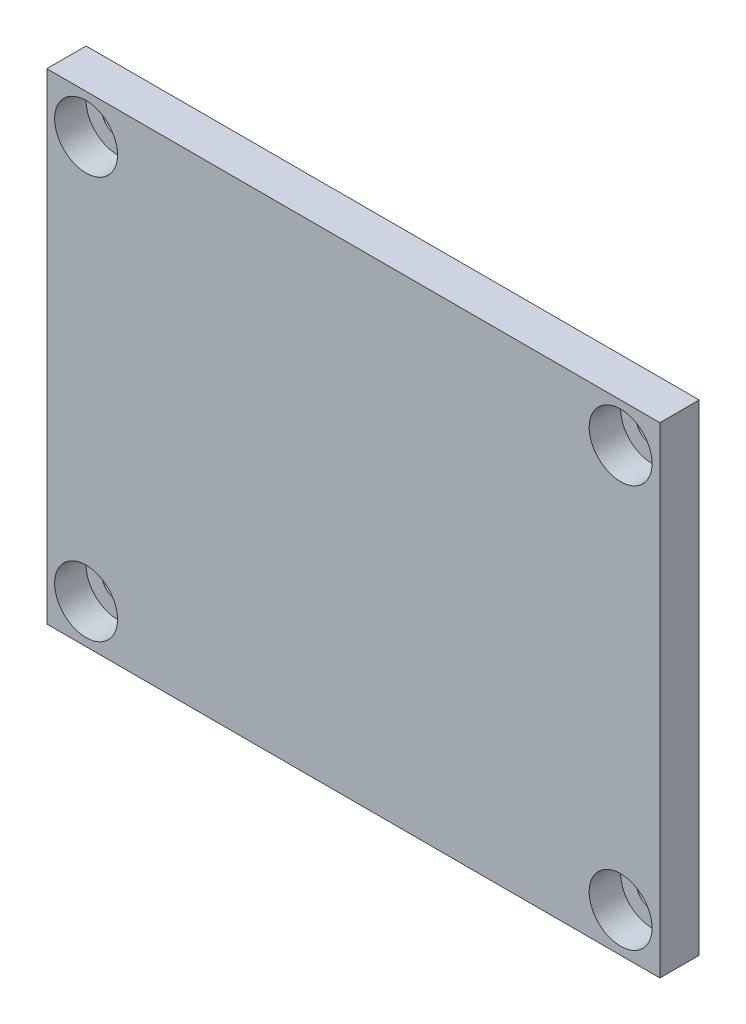
ISO-10303-21;
HEADER;
FILE_DESCRIPTION(('STEP AP214'),'2;1');
FILE_NAME('part.step','',(''),(''),'','','');
FILE_SCHEMA(('AUTOMOTIVE_DESIGN { 1 0 10303 214 1 1 1 1 }'));
ENDSEC;
DATA;
#1=APPLICATION_CONTEXT('core data for automotive mechanical design processes');
#2=APPLICATION_PROTOCOL_DEFINITION('international standard','automotive_design',2000,#1);
#3=PRODUCT_CONTEXT('',#1,'mechanical');
#4=PRODUCT('Part','Part','',(#3));
#5=PRODUCT_RELATED_PRODUCT_CATEGORY('part','',(#4));
#6=PRODUCT_DEFINITION_FORMATION('','',#4);
#7=PRODUCT_DEFINITION_CONTEXT('part definition',#1,'design');
#8=PRODUCT_DEFINITION('design','',#6,#7);
#9=PRODUCT_DEFINITION_SHAPE('','',#8);
#10=(LENGTH_UNIT() NAMED_UNIT(*) SI_UNIT(.MILLI.,.METRE.));
#11=(NAMED_UNIT(*) PLANE_ANGLE_UNIT() SI_UNIT($,.RADIAN.));
#12=(NAMED_UNIT(*) SI_UNIT($,.STERADIAN.) SOLID_ANGLE_UNIT());
#13=UNCERTAINTY_MEASURE_WITH_UNIT(LENGTH_MEASURE(1.E-05),#10,'distance_accuracy_value','');
#14=(GEOMETRIC_REPRESENTATION_CONTEXT(3) GLOBAL_UNCERTAINTY_ASSIGNED_CONTEXT((#13)) GLOBAL_UNIT_ASSIGNED_CONTEXT((#10,
#11,#12)) REPRESENTATION_CONTEXT('',''));
#15=CARTESIAN_POINT('',(0.,0.,0.));
#16=DIRECTION('',(0.,0.,1.));
#17=DIRECTION('',(1.,0.,0.));
#18=AXIS2_PLACEMENT_3D('',#15,#16,#17);
#19=CARTESIAN_POINT('',(0.,30.59,-2.5));
#20=DIRECTION('',(-1.,0.,0.));
#21=DIRECTION('',(0.,-1.,0.));
#22=AXIS2_PLACEMENT_3D('',#19,#20,#21);
#23=PLANE('',#22);
#24=DIRECTION('',(0.,-1.,0.));
#25=VECTOR('',#24,1.);
#26=CARTESIAN_POINT('',(0.,30.59,-2.5));
#27=LINE('',#26,#25);
#28=CARTESIAN_POINT('',(0.,30.59,-2.5));
#29=VERTEX_POINT('',#28);
#30=CARTESIAN_POINT('',(0.,0.,-2.5));
#31=VERTEX_POINT('',#30);
#32=EDGE_CURVE('E78',#29,#31,#27,.T.);
#33=ORIENTED_EDGE('',*,*,#32,.T.);
#34=DIRECTION('',(0.,0.,1.));
#35=VECTOR('',#34,1.);
#36=CARTESIAN_POINT('',(0.,0.,-2.5));
#37=LINE('',#36,#35);
#38=CARTESIAN_POINT('',(0.,0.,0.));
#39=VERTEX_POINT('',#38);
#40=EDGE_CURVE('E89',#31,#39,#37,.T.);
#41=ORIENTED_EDGE('',*,*,#40,.T.);
#42=DIRECTION('',(0.,-1.,0.));
#43=VECTOR('',#42,1.);
#44=CARTESIAN_POINT('',(0.,30.59,0.));
#45=LINE('',#44,#43);
#46=CARTESIAN_POINT('',(0.,30.59,0.));
#47=VERTEX_POINT('',#46);
#48=EDGE_CURVE('E102',#47,#39,#45,.T.);
#49=ORIENTED_EDGE('',*,*,#48,.F.);
#50=DIRECTION('',(0.,0.,1.));
#51=VECTOR('',#50,1.);
#52=CARTESIAN_POINT('',(0.,30.59,-2.5));
#53=LINE('',#52,#51);
#54=EDGE_CURVE('E11',#29,#47,#53,.T.);
#55=ORIENTED_EDGE('',*,*,#54,.F.);
#56=EDGE_LOOP('',(#33,#41,#49,#55));
#57=FACE_BOUND('',#56,.T.);
#58=ADVANCED_FACE('F34',(#57),#23,.T.);
#59=CARTESIAN_POINT('',(39.,30.59,-2.5));
#60=DIRECTION('',(0.,1.,0.));
#61=DIRECTION('',(-1.,0.,0.));
#62=AXIS2_PLACEMENT_3D('',#59,#60,#61);
#63=PLANE('',#62);
#64=ORIENTED_EDGE('',*,*,#54,.T.);
#65=DIRECTION('',(-1.,0.,0.));
#66=VECTOR('',#65,1.);
#67=CARTESIAN_POINT('',(39.,30.59,0.));
#68=LINE('',#67,#66);
#69=CARTESIAN_POINT('',(39.,30.59,0.));
#70=VERTEX_POINT('',#69);
#71=EDGE_CURVE('E72',#70,#47,#68,.T.);
#72=ORIENTED_EDGE('',*,*,#71,.F.);
#73=DIRECTION('',(0.,0.,1.));
#74=VECTOR('',#73,1.);
#75=CARTESIAN_POINT('',(39.,30.59,-2.5));
#76=LINE('',#75,#74);
#77=CARTESIAN_POINT('',(39.,30.59,-2.5));
#78=VERTEX_POINT('',#77);
#79=EDGE_CURVE('E43',#78,#70,#76,.T.);
#80=ORIENTED_EDGE('',*,*,#79,.F.);
#81=DIRECTION('',(-1.,0.,0.));
#82=VECTOR('',#81,1.);
#83=CARTESIAN_POINT('',(39.,30.59,-2.5));
#84=LINE('',#83,#82);
#85=EDGE_CURVE('E51',#78,#29,#84,.T.);
#86=ORIENTED_EDGE('',*,*,#85,.T.);
#87=EDGE_LOOP('',(#64,#72,#80,#86));
#88=FACE_BOUND('',#87,.T.);
#89=ADVANCED_FACE('F180',(#88),#63,.T.);
#90=CARTESIAN_POINT('',(39.,0.,-2.5));
#91=DIRECTION('',(1.,0.,0.));
#92=DIRECTION('',(0.,0.,-1.));
#93=AXIS2_PLACEMENT_3D('',#90,#91,#92);
#94=PLANE('',#93);
#95=DIRECTION('',(0.,1.,0.));
#96=VECTOR('',#95,1.);
#97=CARTESIAN_POINT('',(39.,0.,-2.5));
#98=LINE('',#97,#96);
#99=CARTESIAN_POINT('',(39.,0.,-2.5));
#100=VERTEX_POINT('',#99);
#101=EDGE_CURVE('E92',#100,#78,#98,.T.);
#102=ORIENTED_EDGE('',*,*,#101,.T.);
#103=ORIENTED_EDGE('',*,*,#79,.T.);
#104=DIRECTION('',(0.,1.,0.));
#105=VECTOR('',#104,1.);
#106=CARTESIAN_POINT('',(39.,0.,0.));
#107=LINE('',#106,#105);
#108=CARTESIAN_POINT('',(39.,0.,0.));
#109=VERTEX_POINT('',#108);
#110=EDGE_CURVE('E68',#109,#70,#107,.T.);
#111=ORIENTED_EDGE('',*,*,#110,.F.);
#112=DIRECTION('',(0.,0.,1.));
#113=VECTOR('',#112,1.);
#114=CARTESIAN_POINT('',(39.,0.,-2.5));
#115=LINE('',#114,#113);
#116=EDGE_CURVE('E88',#100,#109,#115,.T.);
#117=ORIENTED_EDGE('',*,*,#116,.F.);
#118=EDGE_LOOP('',(#102,#103,#111,#117));
#119=FACE_BOUND('',#118,.T.);
#120=ADVANCED_FACE('F95',(#119),#94,.T.);
#121=CARTESIAN_POINT('',(0.,0.,-2.5));
#122=DIRECTION('',(0.,-1.,0.));
#123=DIRECTION('',(0.,0.,-1.));
#124=AXIS2_PLACEMENT_3D('',#121,#122,#123);
#125=PLANE('',#124);
#126=ORIENTED_EDGE('',*,*,#116,.T.);
#127=DIRECTION('',(1.,0.,0.));
#128=VECTOR('',#127,1.);
#129=CARTESIAN_POINT('',(0.,0.,0.));
#130=LINE('',#129,#128);
#131=EDGE_CURVE('E104',#39,#109,#130,.T.);
#132=ORIENTED_EDGE('',*,*,#131,.F.);
#133=ORIENTED_EDGE('',*,*,#40,.F.);
#134=DIRECTION('',(1.,0.,0.));
#135=VECTOR('',#134,1.);
#136=CARTESIAN_POINT('',(0.,0.,-2.5));
#137=LINE('',#136,#135);
#138=EDGE_CURVE('E84',#31,#100,#137,.T.);
#139=ORIENTED_EDGE('',*,*,#138,.T.);
#140=EDGE_LOOP('',(#126,#132,#133,#139));
#141=FACE_BOUND('',#140,.T.);
#142=ADVANCED_FACE('F86',(#141),#125,.T.);
#143=CARTESIAN_POINT('',(0.,0.,-2.5));
#144=DIRECTION('',(0.,0.,1.));
#145=DIRECTION('',(1.,0.,0.));
#146=AXIS2_PLACEMENT_3D('',#143,#144,#145);
#147=PLANE('',#146);
#148=CARTESIAN_POINT('',(2.5,28.09,-2.5));
#149=DIRECTION('',(0.,0.,1.));
#150=DIRECTION('',(1.,0.,0.));
#151=AXIS2_PLACEMENT_3D('',#148,#149,#150);
#152=CIRCLE('',#151,0.999999999999998);
#153=CARTESIAN_POINT('',(3.5,28.09,-2.5));
#154=VERTEX_POINT('',#153);
#155=EDGE_CURVE('E37',#154,#154,#152,.T.);
#156=ORIENTED_EDGE('',*,*,#155,.T.);
#157=EDGE_LOOP('',(#156));
#158=FACE_BOUND('',#157,.T.);
#159=CARTESIAN_POINT('',(36.5,2.5,-2.5));
#160=DIRECTION('',(0.,0.,1.));
#161=DIRECTION('',(1.,0.,0.));
#162=AXIS2_PLACEMENT_3D('',#159,#160,#161);
#163=CIRCLE('',#162,0.999999999999997);
#164=CARTESIAN_POINT('',(37.5,2.5,-2.5));
#165=VERTEX_POINT('',#164);
#166=EDGE_CURVE('E118',#165,#165,#163,.T.);
#167=ORIENTED_EDGE('',*,*,#166,.T.);
#168=EDGE_LOOP('',(#167));
#169=FACE_BOUND('',#168,.T.);
#170=CARTESIAN_POINT('',(2.5,2.5,-2.5));
#171=DIRECTION('',(0.,0.,1.));
#172=DIRECTION('',(1.,0.,0.));
#173=AXIS2_PLACEMENT_3D('',#170,#171,#172);
#174=CIRCLE('',#173,0.999999999999999);
#175=CARTESIAN_POINT('',(3.5,2.5,-2.5));
#176=VERTEX_POINT('',#175);
#177=EDGE_CURVE('E114',#176,#176,#174,.T.);
#178=ORIENTED_EDGE('',*,*,#177,.T.);
#179=EDGE_LOOP('',(#178));
#180=FACE_BOUND('',#179,.T.);
#181=CARTESIAN_POINT('',(36.5,28.09,-2.5));
#182=DIRECTION('',(0.,0.,1.));
#183=DIRECTION('',(1.,0.,0.));
#184=AXIS2_PLACEMENT_3D('',#181,#182,#183);
#185=CIRCLE('',#184,1.);
#186=CARTESIAN_POINT('',(37.5,28.09,-2.5));
#187=VERTEX_POINT('',#186);
#188=EDGE_CURVE('E105',#187,#187,#185,.T.);
#189=ORIENTED_EDGE('',*,*,#188,.T.);
#190=EDGE_LOOP('',(#189));
#191=FACE_BOUND('',#190,.T.);
#192=ORIENTED_EDGE('',*,*,#85,.F.);
#193=ORIENTED_EDGE('',*,*,#101,.F.);
#194=ORIENTED_EDGE('',*,*,#138,.F.);
#195=ORIENTED_EDGE('',*,*,#32,.F.);
#196=EDGE_LOOP('',(#192,#193,#194,#195));
#197=FACE_BOUND('',#196,.T.);
#198=ADVANCED_FACE('F97',(#158,#169,#180,#191,#197),#147,.F.);
#199=CARTESIAN_POINT('',(0.,0.,0.));
#200=DIRECTION('',(0.,0.,1.));
#201=DIRECTION('',(1.,0.,0.));
#202=AXIS2_PLACEMENT_3D('',#199,#200,#201);
#203=PLANE('',#202);
#204=CARTESIAN_POINT('',(2.5,28.09,0.));
#205=DIRECTION('',(0.,0.,1.));
#206=DIRECTION('',(1.,0.,0.));
#207=AXIS2_PLACEMENT_3D('',#204,#205,#206);
#208=CIRCLE('',#207,2.);
#209=CARTESIAN_POINT('',(4.5,28.09,0.));
#210=VERTEX_POINT('',#209);
#211=EDGE_CURVE('E327',#210,#210,#208,.T.);
#212=ORIENTED_EDGE('',*,*,#211,.F.);
#213=EDGE_LOOP('',(#212));
#214=FACE_BOUND('',#213,.T.);
#215=CARTESIAN_POINT('',(36.5,2.5,0.));
#216=DIRECTION('',(0.,0.,1.));
#217=DIRECTION('',(1.,0.,0.));
#218=AXIS2_PLACEMENT_3D('',#215,#216,#217);
#219=CIRCLE('',#218,2.);
#220=CARTESIAN_POINT('',(38.5,2.5,0.));
#221=VERTEX_POINT('',#220);
#222=EDGE_CURVE('E133',#221,#221,#219,.T.);
#223=ORIENTED_EDGE('',*,*,#222,.F.);
#224=EDGE_LOOP('',(#223));
#225=FACE_BOUND('',#224,.T.);
#226=CARTESIAN_POINT('',(2.5,2.5,0.));
#227=DIRECTION('',(0.,0.,1.));
#228=DIRECTION('',(1.,0.,0.));
#229=AXIS2_PLACEMENT_3D('',#226,#227,#228);
#230=CIRCLE('',#229,2.);
#231=CARTESIAN_POINT('',(4.5,2.5,0.));
#232=VERTEX_POINT('',#231);
#233=EDGE_CURVE('E120',#232,#232,#230,.T.);
#234=ORIENTED_EDGE('',*,*,#233,.F.);
#235=EDGE_LOOP('',(#234));
#236=FACE_BOUND('',#235,.T.);
#237=CARTESIAN_POINT('',(36.5,28.09,0.));
#238=DIRECTION('',(0.,0.,1.));
#239=DIRECTION('',(1.,0.,0.));
#240=AXIS2_PLACEMENT_3D('',#237,#238,#239);
#241=CIRCLE('',#240,2.);
#242=CARTESIAN_POINT('',(38.5,28.09,0.));
#243=VERTEX_POINT('',#242);
#244=EDGE_CURVE('E116',#243,#243,#241,.T.);
#245=ORIENTED_EDGE('',*,*,#244,.F.);
#246=EDGE_LOOP('',(#245));
#247=FACE_BOUND('',#246,.T.);
#248=ORIENTED_EDGE('',*,*,#110,.T.);
#249=ORIENTED_EDGE('',*,*,#71,.T.);
#250=ORIENTED_EDGE('',*,*,#48,.T.);
#251=ORIENTED_EDGE('',*,*,#131,.T.);
#252=EDGE_LOOP('',(#248,#249,#250,#251));
#253=FACE_BOUND('',#252,.T.);
#254=ADVANCED_FACE('F165',(#214,#225,#236,#247,#253),#203,.T.);
#255=CARTESIAN_POINT('',(36.5,28.09,0.));
#256=DIRECTION('',(0.,0.,1.));
#257=DIRECTION('',(1.,0.,0.));
#258=AXIS2_PLACEMENT_3D('',#255,#256,#257);
#259=CYLINDRICAL_SURFACE('',#258,1.);
#260=CARTESIAN_POINT('',(36.5,28.09,-2.));
#261=DIRECTION('',(0.,0.,1.));
#262=DIRECTION('',(1.,0.,0.));
#263=AXIS2_PLACEMENT_3D('',#260,#261,#262);
#264=CIRCLE('',#263,1.);
#265=CARTESIAN_POINT('',(37.5,28.09,-2.));
#266=VERTEX_POINT('',#265);
#267=EDGE_CURVE('E113',#266,#266,#264,.T.);
#268=ORIENTED_EDGE('',*,*,#267,.T.);
#269=EDGE_LOOP('',(#268));
#270=FACE_BOUND('',#269,.T.);
#271=ORIENTED_EDGE('',*,*,#188,.F.);
#272=EDGE_LOOP('',(#271));
#273=FACE_BOUND('',#272,.T.);
#274=ADVANCED_FACE('F149',(#270,#273),#259,.F.);
#275=CARTESIAN_POINT('',(37.5,28.09,-2.));
#276=DIRECTION('',(0.,0.,-1.));
#277=DIRECTION('',(-1.,0.,0.));
#278=AXIS2_PLACEMENT_3D('',#275,#276,#277);
#279=PLANE('',#278);
#280=ORIENTED_EDGE('',*,*,#267,.F.);
#281=EDGE_LOOP('',(#280));
#282=FACE_BOUND('',#281,.T.);
#283=CARTESIAN_POINT('',(36.5,28.09,-2.));
#284=DIRECTION('',(0.,0.,1.));
#285=DIRECTION('',(1.,0.,0.));
#286=AXIS2_PLACEMENT_3D('',#283,#284,#285);
#287=CIRCLE('',#286,2.);
#288=CARTESIAN_POINT('',(38.5,28.09,-2.));
#289=VERTEX_POINT('',#288);
#290=EDGE_CURVE('E143',#289,#289,#287,.T.);
#291=ORIENTED_EDGE('',*,*,#290,.T.);
#292=EDGE_LOOP('',(#291));
#293=FACE_BOUND('',#292,.T.);
#294=ADVANCED_FACE('F152',(#282,#293),#279,.F.);
#295=CARTESIAN_POINT('',(36.5,28.09,0.));
#296=DIRECTION('',(0.,0.,1.));
#297=DIRECTION('',(1.,0.,0.));
#298=AXIS2_PLACEMENT_3D('',#295,#296,#297);
#299=CYLINDRICAL_SURFACE('',#298,2.);
#300=ORIENTED_EDGE('',*,*,#290,.F.);
#301=EDGE_LOOP('',(#300));
#302=FACE_BOUND('',#301,.T.);
#303=ORIENTED_EDGE('',*,*,#244,.T.);
#304=EDGE_LOOP('',(#303));
#305=FACE_BOUND('',#304,.T.);
#306=ADVANCED_FACE('F155',(#302,#305),#299,.F.);
#307=CARTESIAN_POINT('',(2.5,2.5,0.));
#308=DIRECTION('',(0.,0.,1.));
#309=DIRECTION('',(1.,0.,0.));
#310=AXIS2_PLACEMENT_3D('',#307,#308,#309);
#311=CYLINDRICAL_SURFACE('',#310,0.999999999999999);
#312=CARTESIAN_POINT('',(2.5,2.5,-2.));
#313=DIRECTION('',(0.,0.,1.));
#314=DIRECTION('',(1.,0.,0.));
#315=AXIS2_PLACEMENT_3D('',#312,#313,#314);
#316=CIRCLE('',#315,0.999999999999999);
#317=CARTESIAN_POINT('',(3.5,2.5,-2.));
#318=VERTEX_POINT('',#317);
#319=EDGE_CURVE('E117',#318,#318,#316,.T.);
#320=ORIENTED_EDGE('',*,*,#319,.T.);
#321=EDGE_LOOP('',(#320));
#322=FACE_BOUND('',#321,.T.);
#323=ORIENTED_EDGE('',*,*,#177,.F.);
#324=EDGE_LOOP('',(#323));
#325=FACE_BOUND('',#324,.T.);
#326=ADVANCED_FACE('F161',(#322,#325),#311,.F.);
#327=CARTESIAN_POINT('',(3.5,2.5,-2.));
#328=DIRECTION('',(0.,0.,-1.));
#329=DIRECTION('',(-1.,0.,0.));
#330=AXIS2_PLACEMENT_3D('',#327,#328,#329);
#331=PLANE('',#330);
#332=ORIENTED_EDGE('',*,*,#319,.F.);
#333=EDGE_LOOP('',(#332));
#334=FACE_BOUND('',#333,.T.);
#335=CARTESIAN_POINT('',(2.5,2.5,-2.));
#336=DIRECTION('',(0.,0.,1.));
#337=DIRECTION('',(1.,0.,0.));
#338=AXIS2_PLACEMENT_3D('',#335,#336,#337);
#339=CIRCLE('',#338,2.);
#340=CARTESIAN_POINT('',(4.5,2.5,-2.));
#341=VERTEX_POINT('',#340);
#342=EDGE_CURVE('E125',#341,#341,#339,.T.);
#343=ORIENTED_EDGE('',*,*,#342,.T.);
#344=EDGE_LOOP('',(#343));
#345=FACE_BOUND('',#344,.T.);
#346=ADVANCED_FACE('F276',(#334,#345),#331,.F.);
#347=CARTESIAN_POINT('',(2.5,2.5,0.));
#348=DIRECTION('',(0.,0.,1.));
#349=DIRECTION('',(1.,0.,0.));
#350=AXIS2_PLACEMENT_3D('',#347,#348,#349);
#351=CYLINDRICAL_SURFACE('',#350,2.);
#352=ORIENTED_EDGE('',*,*,#342,.F.);
#353=EDGE_LOOP('',(#352));
#354=FACE_BOUND('',#353,.T.);
#355=ORIENTED_EDGE('',*,*,#233,.T.);
#356=EDGE_LOOP('',(#355));
#357=FACE_BOUND('',#356,.T.);
#358=ADVANCED_FACE('F204',(#354,#357),#351,.F.);
#359=CARTESIAN_POINT('',(36.5,2.5,0.));
#360=DIRECTION('',(0.,0.,1.));
#361=DIRECTION('',(1.,0.,0.));
#362=AXIS2_PLACEMENT_3D('',#359,#360,#361);
#363=CYLINDRICAL_SURFACE('',#362,0.999999999999997);
#364=CARTESIAN_POINT('',(36.5,2.5,-2.));
#365=DIRECTION('',(0.,0.,1.));
#366=DIRECTION('',(1.,0.,0.));
#367=AXIS2_PLACEMENT_3D('',#364,#365,#366);
#368=CIRCLE('',#367,1.);
#369=CARTESIAN_POINT('',(37.5,2.5,-2.));
#370=VERTEX_POINT('',#369);
#371=EDGE_CURVE('E121',#370,#370,#368,.T.);
#372=ORIENTED_EDGE('',*,*,#371,.T.);
#373=EDGE_LOOP('',(#372));
#374=FACE_BOUND('',#373,.T.);
#375=ORIENTED_EDGE('',*,*,#166,.F.);
#376=EDGE_LOOP('',(#375));
#377=FACE_BOUND('',#376,.T.);
#378=ADVANCED_FACE('F214',(#374,#377),#363,.F.);
#379=CARTESIAN_POINT('',(37.5,2.5,-2.));
#380=DIRECTION('',(0.,0.,-1.));
#381=DIRECTION('',(-1.,0.,0.));
#382=AXIS2_PLACEMENT_3D('',#379,#380,#381);
#383=PLANE('',#382);
#384=ORIENTED_EDGE('',*,*,#371,.F.);
#385=EDGE_LOOP('',(#384));
#386=FACE_BOUND('',#385,.T.);
#387=CARTESIAN_POINT('',(36.5,2.5,-2.));
#388=DIRECTION('',(0.,0.,1.));
#389=DIRECTION('',(1.,0.,0.));
#390=AXIS2_PLACEMENT_3D('',#387,#388,#389);
#391=CIRCLE('',#390,2.);
#392=CARTESIAN_POINT('',(38.5,2.5,-2.));
#393=VERTEX_POINT('',#392);
#394=EDGE_CURVE('E128',#393,#393,#391,.T.);
#395=ORIENTED_EDGE('',*,*,#394,.T.);
#396=EDGE_LOOP('',(#395));
#397=FACE_BOUND('',#396,.T.);
#398=ADVANCED_FACE('F219',(#386,#397),#383,.F.);
#399=CARTESIAN_POINT('',(36.5,2.5,0.));
#400=DIRECTION('',(0.,0.,1.));
#401=DIRECTION('',(1.,0.,0.));
#402=AXIS2_PLACEMENT_3D('',#399,#400,#401);
#403=CYLINDRICAL_SURFACE('',#402,2.);
#404=ORIENTED_EDGE('',*,*,#394,.F.);
#405=EDGE_LOOP('',(#404));
#406=FACE_BOUND('',#405,.T.);
#407=ORIENTED_EDGE('',*,*,#222,.T.);
#408=EDGE_LOOP('',(#407));
#409=FACE_BOUND('',#408,.T.);
#410=ADVANCED_FACE('F228',(#406,#409),#403,.F.);
#411=CARTESIAN_POINT('',(2.5,28.09,0.));
#412=DIRECTION('',(0.,0.,1.));
#413=DIRECTION('',(1.,0.,0.));
#414=AXIS2_PLACEMENT_3D('',#411,#412,#413);
#415=CYLINDRICAL_SURFACE('',#414,0.999999999999998);
#416=CARTESIAN_POINT('',(2.5,28.09,-2.));
#417=DIRECTION('',(0.,0.,1.));
#418=DIRECTION('',(1.,0.,0.));
#419=AXIS2_PLACEMENT_3D('',#416,#417,#418);
#420=CIRCLE('',#419,0.999999999999999);
#421=CARTESIAN_POINT('',(3.5,28.09,-2.));
#422=VERTEX_POINT('',#421);
#423=EDGE_CURVE('E329',#422,#422,#420,.T.);
#424=ORIENTED_EDGE('',*,*,#423,.T.);
#425=EDGE_LOOP('',(#424));
#426=FACE_BOUND('',#425,.T.);
#427=ORIENTED_EDGE('',*,*,#155,.F.);
#428=EDGE_LOOP('',(#427));
#429=FACE_BOUND('',#428,.T.);
#430=ADVANCED_FACE('F238',(#426,#429),#415,.F.);
#431=CARTESIAN_POINT('',(3.5,28.09,-2.));
#432=DIRECTION('',(0.,0.,-1.));
#433=DIRECTION('',(-1.,0.,0.));
#434=AXIS2_PLACEMENT_3D('',#431,#432,#433);
#435=PLANE('',#434);
#436=ORIENTED_EDGE('',*,*,#423,.F.);
#437=EDGE_LOOP('',(#436));
#438=FACE_BOUND('',#437,.T.);
#439=CARTESIAN_POINT('',(2.5,28.09,-2.));
#440=DIRECTION('',(0.,0.,1.));
#441=DIRECTION('',(1.,0.,0.));
#442=AXIS2_PLACEMENT_3D('',#439,#440,#441);
#443=CIRCLE('',#442,2.);
#444=CARTESIAN_POINT('',(4.5,28.09,-2.));
#445=VERTEX_POINT('',#444);
#446=EDGE_CURVE('E325',#445,#445,#443,.T.);
#447=ORIENTED_EDGE('',*,*,#446,.T.);
#448=EDGE_LOOP('',(#447));
#449=FACE_BOUND('',#448,.T.);
#450=ADVANCED_FACE('F248',(#438,#449),#435,.F.);
#451=CARTESIAN_POINT('',(2.5,28.09,0.));
#452=DIRECTION('',(0.,0.,1.));
#453=DIRECTION('',(1.,0.,0.));
#454=AXIS2_PLACEMENT_3D('',#451,#452,#453);
#455=CYLINDRICAL_SURFACE('',#454,2.);
#456=ORIENTED_EDGE('',*,*,#446,.F.);
#457=EDGE_LOOP('',(#456));
#458=FACE_BOUND('',#457,.T.);
#459=ORIENTED_EDGE('',*,*,#211,.T.);
#460=EDGE_LOOP('',(#459));
#461=FACE_BOUND('',#460,.T.);
#462=ADVANCED_FACE('F258',(#458,#461),#455,.F.);
#463=CLOSED_SHELL('',(#58,#89,#120,#142,#198,#254,#274,#294,#306,#326,#346,#358,#378,#398,#410,
#430,#450,#462));
#464=MANIFOLD_SOLID_BREP('B2',#463);
#465=ADVANCED_BREP_SHAPE_REPRESENTATION('',(#18,#464),#14);
#466=SHAPE_DEFINITION_REPRESENTATION(#9,#465);
ENDSEC;
END-ISO-10303-21;
